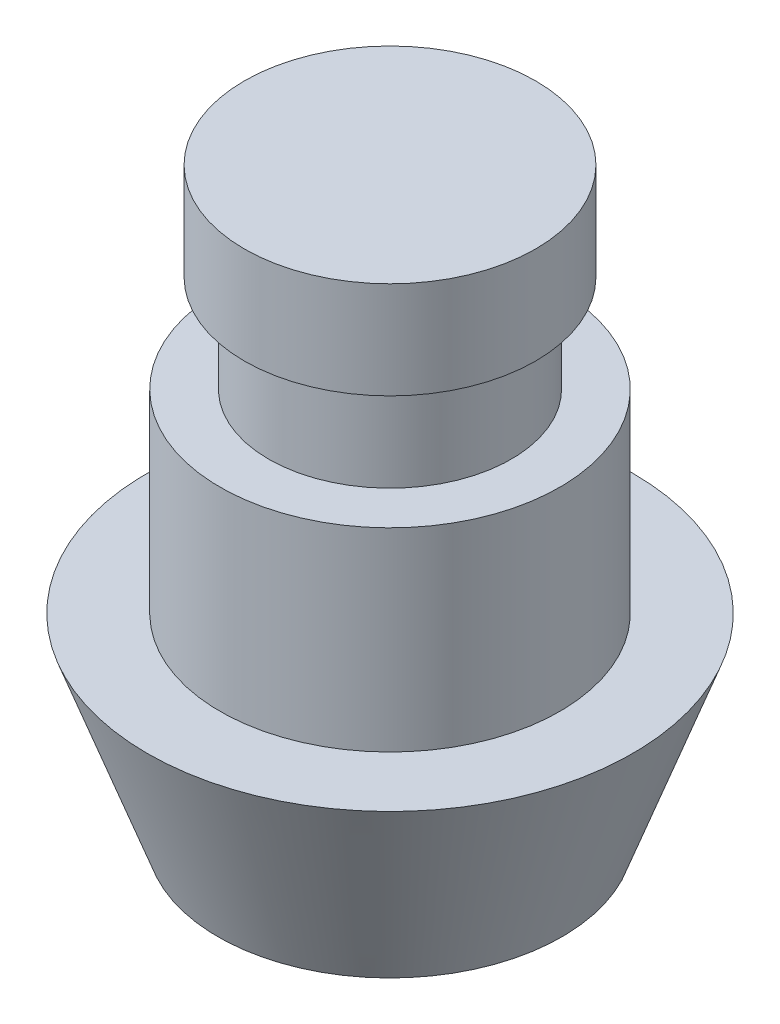
ISO-10303-21;
HEADER;
FILE_DESCRIPTION(('STEP AP214'),'2;1');
FILE_NAME('part.step','',(''),(''),'','','');
FILE_SCHEMA(('AUTOMOTIVE_DESIGN { 1 0 10303 214 1 1 1 1 }'));
ENDSEC;
DATA;
#1=APPLICATION_CONTEXT('core data for automotive mechanical design processes');
#2=APPLICATION_PROTOCOL_DEFINITION('international standard','automotive_design',2000,#1);
#3=PRODUCT_CONTEXT('',#1,'mechanical');
#4=PRODUCT('Part','Part','',(#3));
#5=PRODUCT_RELATED_PRODUCT_CATEGORY('part','',(#4));
#6=PRODUCT_DEFINITION_FORMATION('','',#4);
#7=PRODUCT_DEFINITION_CONTEXT('part definition',#1,'design');
#8=PRODUCT_DEFINITION('design','',#6,#7);
#9=PRODUCT_DEFINITION_SHAPE('','',#8);
#10=(LENGTH_UNIT() NAMED_UNIT(*) SI_UNIT(.MILLI.,.METRE.));
#11=(NAMED_UNIT(*) PLANE_ANGLE_UNIT() SI_UNIT($,.RADIAN.));
#12=(NAMED_UNIT(*) SI_UNIT($,.STERADIAN.) SOLID_ANGLE_UNIT());
#13=UNCERTAINTY_MEASURE_WITH_UNIT(LENGTH_MEASURE(1.E-05),#10,'distance_accuracy_value','');
#14=(GEOMETRIC_REPRESENTATION_CONTEXT(3) GLOBAL_UNCERTAINTY_ASSIGNED_CONTEXT((#13)) GLOBAL_UNIT_ASSIGNED_CONTEXT((#10,
#11,#12)) REPRESENTATION_CONTEXT('',''));
#15=CARTESIAN_POINT('',(0.,0.,0.));
#16=DIRECTION('',(0.,0.,1.));
#17=DIRECTION('',(1.,0.,0.));
#18=AXIS2_PLACEMENT_3D('',#15,#16,#17);
#19=CARTESIAN_POINT('',(0.,2.,0.));
#20=DIRECTION('',(0.,-1.,0.));
#21=DIRECTION('',(0.,0.,-1.));
#22=AXIS2_PLACEMENT_3D('',#19,#20,#21);
#23=CYLINDRICAL_SURFACE('',#22,3.);
#24=CARTESIAN_POINT('',(0.,2.,0.));
#25=DIRECTION('',(0.,1.,0.));
#26=DIRECTION('',(0.,0.,1.));
#27=AXIS2_PLACEMENT_3D('',#24,#25,#26);
#28=CIRCLE('',#27,3.);
#29=CARTESIAN_POINT('',(0.,2.,3.));
#30=VERTEX_POINT('',#29);
#31=EDGE_CURVE('E57',#30,#30,#28,.T.);
#32=ORIENTED_EDGE('',*,*,#31,.F.);
#33=EDGE_LOOP('',(#32));
#34=FACE_BOUND('',#33,.T.);
#35=CARTESIAN_POINT('',(0.,0.,0.));
#36=DIRECTION('',(0.,1.,0.));
#37=DIRECTION('',(0.,0.,1.));
#38=AXIS2_PLACEMENT_3D('',#35,#36,#37);
#39=CIRCLE('',#38,3.);
#40=CARTESIAN_POINT('',(0.,0.,3.));
#41=VERTEX_POINT('',#40);
#42=EDGE_CURVE('E52',#41,#41,#39,.T.);
#43=ORIENTED_EDGE('',*,*,#42,.T.);
#44=EDGE_LOOP('',(#43));
#45=FACE_BOUND('',#44,.T.);
#46=ADVANCED_FACE('F49',(#34,#45),#23,.T.);
#47=CARTESIAN_POINT('',(0.,2.,0.));
#48=DIRECTION('',(0.,1.,0.));
#49=DIRECTION('',(0.,0.,1.));
#50=AXIS2_PLACEMENT_3D('',#47,#48,#49);
#51=PLANE('',#50);
#52=ORIENTED_EDGE('',*,*,#31,.T.);
#53=EDGE_LOOP('',(#52));
#54=FACE_BOUND('',#53,.T.);
#55=ADVANCED_FACE('F99',(#54),#51,.T.);
#56=CARTESIAN_POINT('',(0.,0.,0.));
#57=DIRECTION('',(0.,1.,0.));
#58=DIRECTION('',(0.,0.,1.));
#59=AXIS2_PLACEMENT_3D('',#56,#57,#58);
#60=PLANE('',#59);
#61=CARTESIAN_POINT('',(0.,0.,0.));
#62=DIRECTION('',(0.,-1.,0.));
#63=DIRECTION('',(0.,0.,-1.));
#64=AXIS2_PLACEMENT_3D('',#61,#62,#63);
#65=CIRCLE('',#64,2.5);
#66=CARTESIAN_POINT('',(0.,0.,-2.5));
#67=VERTEX_POINT('',#66);
#68=EDGE_CURVE('E10',#67,#67,#65,.T.);
#69=ORIENTED_EDGE('',*,*,#68,.F.);
#70=EDGE_LOOP('',(#69));
#71=FACE_BOUND('',#70,.T.);
#72=ORIENTED_EDGE('',*,*,#42,.F.);
#73=EDGE_LOOP('',(#72));
#74=FACE_BOUND('',#73,.T.);
#75=ADVANCED_FACE('F104',(#71,#74),#60,.F.);
#76=CARTESIAN_POINT('',(0.,-2.,0.));
#77=DIRECTION('',(0.,1.,0.));
#78=DIRECTION('',(0.,0.,1.));
#79=AXIS2_PLACEMENT_3D('',#76,#77,#78);
#80=CYLINDRICAL_SURFACE('',#79,2.5);
#81=CARTESIAN_POINT('',(0.,-2.,0.));
#82=DIRECTION('',(0.,-1.,0.));
#83=DIRECTION('',(0.,0.,-1.));
#84=AXIS2_PLACEMENT_3D('',#81,#82,#83);
#85=CIRCLE('',#84,2.5);
#86=CARTESIAN_POINT('',(0.,-2.,-2.5));
#87=VERTEX_POINT('',#86);
#88=EDGE_CURVE('E64',#87,#87,#85,.T.);
#89=ORIENTED_EDGE('',*,*,#88,.F.);
#90=EDGE_LOOP('',(#89));
#91=FACE_BOUND('',#90,.T.);
#92=ORIENTED_EDGE('',*,*,#68,.T.);
#93=EDGE_LOOP('',(#92));
#94=FACE_BOUND('',#93,.T.);
#95=ADVANCED_FACE('F114',(#91,#94),#80,.T.);
#96=CARTESIAN_POINT('',(0.,-6.,0.));
#97=DIRECTION('',(0.,1.,0.));
#98=DIRECTION('',(0.,0.,1.));
#99=AXIS2_PLACEMENT_3D('',#96,#97,#98);
#100=CYLINDRICAL_SURFACE('',#99,3.5);
#101=CARTESIAN_POINT('',(0.,-6.,0.));
#102=DIRECTION('',(0.,-1.,0.));
#103=DIRECTION('',(0.,0.,-1.));
#104=AXIS2_PLACEMENT_3D('',#101,#102,#103);
#105=CIRCLE('',#104,3.5);
#106=CARTESIAN_POINT('',(0.,-6.,-3.5));
#107=VERTEX_POINT('',#106);
#108=EDGE_CURVE('E68',#107,#107,#105,.T.);
#109=ORIENTED_EDGE('',*,*,#108,.F.);
#110=EDGE_LOOP('',(#109));
#111=FACE_BOUND('',#110,.T.);
#112=CARTESIAN_POINT('',(0.,-2.,0.));
#113=DIRECTION('',(0.,-1.,0.));
#114=DIRECTION('',(0.,0.,-1.));
#115=AXIS2_PLACEMENT_3D('',#112,#113,#114);
#116=CIRCLE('',#115,3.5);
#117=CARTESIAN_POINT('',(0.,-2.,-3.5));
#118=VERTEX_POINT('',#117);
#119=EDGE_CURVE('E69',#118,#118,#116,.T.);
#120=ORIENTED_EDGE('',*,*,#119,.T.);
#121=EDGE_LOOP('',(#120));
#122=FACE_BOUND('',#121,.T.);
#123=ADVANCED_FACE('F119',(#111,#122),#100,.T.);
#124=CARTESIAN_POINT('',(0.,-2.,0.));
#125=DIRECTION('',(0.,-1.,0.));
#126=DIRECTION('',(0.,0.,-1.));
#127=AXIS2_PLACEMENT_3D('',#124,#125,#126);
#128=PLANE('',#127);
#129=ORIENTED_EDGE('',*,*,#88,.T.);
#130=EDGE_LOOP('',(#129));
#131=FACE_BOUND('',#130,.T.);
#132=ORIENTED_EDGE('',*,*,#119,.F.);
#133=EDGE_LOOP('',(#132));
#134=FACE_BOUND('',#133,.T.);
#135=ADVANCED_FACE('F125',(#131,#134),#128,.F.);
#136=CARTESIAN_POINT('',(0.,-6.,0.));
#137=DIRECTION('',(0.,1.,0.));
#138=DIRECTION('',(0.,0.,-1.));
#139=AXIS2_PLACEMENT_3D('',#136,#137,#138);
#140=CONICAL_SURFACE('',#139,5.,0.349065850398867);
#141=CARTESIAN_POINT('',(0.,-10.,0.));
#142=DIRECTION('',(0.,-1.,0.));
#143=DIRECTION('',(0.,0.,-1.));
#144=AXIS2_PLACEMENT_3D('',#141,#142,#143);
#145=CIRCLE('',#144,3.54411906293519);
#146=CARTESIAN_POINT('',(0.,-10.,-3.54411906293519));
#147=VERTEX_POINT('',#146);
#148=EDGE_CURVE('E73',#147,#147,#145,.T.);
#149=ORIENTED_EDGE('',*,*,#148,.F.);
#150=EDGE_LOOP('',(#149));
#151=FACE_BOUND('',#150,.T.);
#152=CARTESIAN_POINT('',(0.,-6.,0.));
#153=DIRECTION('',(0.,-1.,0.));
#154=DIRECTION('',(0.,0.,-1.));
#155=AXIS2_PLACEMENT_3D('',#152,#153,#154);
#156=CIRCLE('',#155,5.);
#157=CARTESIAN_POINT('',(0.,-6.,-5.));
#158=VERTEX_POINT('',#157);
#159=EDGE_CURVE('E80',#158,#158,#156,.T.);
#160=ORIENTED_EDGE('',*,*,#159,.T.);
#161=EDGE_LOOP('',(#160));
#162=FACE_BOUND('',#161,.T.);
#163=ADVANCED_FACE('F85',(#151,#162),#140,.T.);
#164=CARTESIAN_POINT('',(0.,-10.,0.));
#165=DIRECTION('',(0.,-1.,0.));
#166=DIRECTION('',(0.,0.,-1.));
#167=AXIS2_PLACEMENT_3D('',#164,#165,#166);
#168=PLANE('',#167);
#169=ORIENTED_EDGE('',*,*,#148,.T.);
#170=EDGE_LOOP('',(#169));
#171=FACE_BOUND('',#170,.T.);
#172=ADVANCED_FACE('F89',(#171),#168,.T.);
#173=CARTESIAN_POINT('',(0.,-6.,0.));
#174=DIRECTION('',(0.,-1.,0.));
#175=DIRECTION('',(0.,0.,-1.));
#176=AXIS2_PLACEMENT_3D('',#173,#174,#175);
#177=PLANE('',#176);
#178=ORIENTED_EDGE('',*,*,#108,.T.);
#179=EDGE_LOOP('',(#178));
#180=FACE_BOUND('',#179,.T.);
#181=ORIENTED_EDGE('',*,*,#159,.F.);
#182=EDGE_LOOP('',(#181));
#183=FACE_BOUND('',#182,.T.);
#184=ADVANCED_FACE('F87',(#180,#183),#177,.F.);
#185=CLOSED_SHELL('',(#46,#55,#75,#95,#123,#135,#163,#172,#184));
#186=MANIFOLD_SOLID_BREP('B2',#185);
#187=ADVANCED_BREP_SHAPE_REPRESENTATION('',(#18,#186),#14);
#188=SHAPE_DEFINITION_REPRESENTATION(#9,#187);
ENDSEC;
END-ISO-10303-21;
